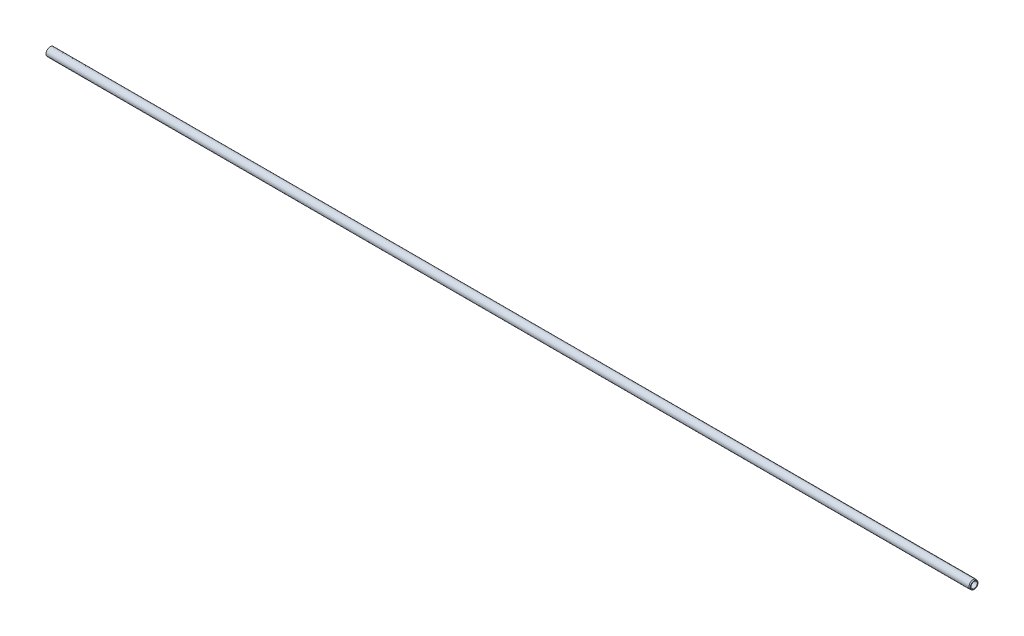
ISO-10303-21;
HEADER;
FILE_DESCRIPTION(('STEP AP214'),'2;1');
FILE_NAME('part.step','',(''),(''),'','','');
FILE_SCHEMA(('AUTOMOTIVE_DESIGN { 1 0 10303 214 1 1 1 1 }'));
ENDSEC;
DATA;
#1=APPLICATION_CONTEXT('core data for automotive mechanical design processes');
#2=APPLICATION_PROTOCOL_DEFINITION('international standard','automotive_design',2000,#1);
#3=PRODUCT_CONTEXT('',#1,'mechanical');
#4=PRODUCT('Part','Part','',(#3));
#5=PRODUCT_RELATED_PRODUCT_CATEGORY('part','',(#4));
#6=PRODUCT_DEFINITION_FORMATION('','',#4);
#7=PRODUCT_DEFINITION_CONTEXT('part definition',#1,'design');
#8=PRODUCT_DEFINITION('design','',#6,#7);
#9=PRODUCT_DEFINITION_SHAPE('','',#8);
#10=(LENGTH_UNIT() NAMED_UNIT(*) SI_UNIT(.MILLI.,.METRE.));
#11=(NAMED_UNIT(*) PLANE_ANGLE_UNIT() SI_UNIT($,.RADIAN.));
#12=(NAMED_UNIT(*) SI_UNIT($,.STERADIAN.) SOLID_ANGLE_UNIT());
#13=UNCERTAINTY_MEASURE_WITH_UNIT(LENGTH_MEASURE(1.E-05),#10,'distance_accuracy_value','');
#14=(GEOMETRIC_REPRESENTATION_CONTEXT(3) GLOBAL_UNCERTAINTY_ASSIGNED_CONTEXT((#13)) GLOBAL_UNIT_ASSIGNED_CONTEXT((#10,
#11,#12)) REPRESENTATION_CONTEXT('',''));
#15=CARTESIAN_POINT('',(0.,0.,0.));
#16=DIRECTION('',(0.,0.,1.));
#17=DIRECTION('',(1.,0.,0.));
#18=AXIS2_PLACEMENT_3D('',#15,#16,#17);
#19=CARTESIAN_POINT('',(0.,0.,0.));
#20=DIRECTION('',(-1.,0.,0.));
#21=DIRECTION('',(0.,0.,1.));
#22=AXIS2_PLACEMENT_3D('',#19,#20,#21);
#23=CYLINDRICAL_SURFACE('',#22,10.);
#24=CARTESIAN_POINT('',(2205.5,0.,0.));
#25=DIRECTION('',(-1.,0.,0.));
#26=DIRECTION('',(0.,0.,1.));
#27=AXIS2_PLACEMENT_3D('',#24,#25,#26);
#28=CIRCLE('',#27,10.);
#29=CARTESIAN_POINT('',(2205.5,0.,10.));
#30=VERTEX_POINT('',#29);
#31=EDGE_CURVE('E10',#30,#30,#28,.T.);
#32=ORIENTED_EDGE('',*,*,#31,.T.);
#33=EDGE_LOOP('',(#32));
#34=FACE_BOUND('',#33,.T.);
#35=CARTESIAN_POINT('',(0.,0.,0.));
#36=DIRECTION('',(-1.,0.,0.));
#37=DIRECTION('',(0.,0.,1.));
#38=AXIS2_PLACEMENT_3D('',#35,#36,#37);
#39=CIRCLE('',#38,10.);
#40=CARTESIAN_POINT('',(0.,0.,10.));
#41=VERTEX_POINT('',#40);
#42=EDGE_CURVE('E64',#41,#41,#39,.T.);
#43=ORIENTED_EDGE('',*,*,#42,.F.);
#44=EDGE_LOOP('',(#43));
#45=FACE_BOUND('',#44,.T.);
#46=ADVANCED_FACE('F45',(#34,#45),#23,.T.);
#47=CARTESIAN_POINT('',(2205.5,0.,0.));
#48=DIRECTION('',(-1.,0.,0.));
#49=DIRECTION('',(0.,0.,1.));
#50=AXIS2_PLACEMENT_3D('',#47,#48,#49);
#51=CONICAL_SURFACE('',#50,10.,0.349065850398866);
#52=CARTESIAN_POINT('',(2208.,0.,0.));
#53=DIRECTION('',(-1.,0.,0.));
#54=DIRECTION('',(0.,0.,1.));
#55=AXIS2_PLACEMENT_3D('',#52,#53,#54);
#56=CIRCLE('',#55,9.09007441433451);
#57=CARTESIAN_POINT('',(2208.,0.,9.09007441433451));
#58=VERTEX_POINT('',#57);
#59=EDGE_CURVE('E51',#58,#58,#56,.T.);
#60=ORIENTED_EDGE('',*,*,#59,.T.);
#61=EDGE_LOOP('',(#60));
#62=FACE_BOUND('',#61,.T.);
#63=ORIENTED_EDGE('',*,*,#31,.F.);
#64=EDGE_LOOP('',(#63));
#65=FACE_BOUND('',#64,.T.);
#66=ADVANCED_FACE('F71',(#62,#65),#51,.T.);
#67=CARTESIAN_POINT('',(2208.,9.09007441433451,0.));
#68=DIRECTION('',(1.,0.,0.));
#69=DIRECTION('',(0.,0.,-1.));
#70=AXIS2_PLACEMENT_3D('',#67,#68,#69);
#71=PLANE('',#70);
#72=CARTESIAN_POINT('',(2208.,0.,0.));
#73=DIRECTION('',(-1.,0.,0.));
#74=DIRECTION('',(0.,0.,1.));
#75=AXIS2_PLACEMENT_3D('',#72,#73,#74);
#76=CIRCLE('',#75,7.5);
#77=CARTESIAN_POINT('',(2208.,0.,7.5));
#78=VERTEX_POINT('',#77);
#79=EDGE_CURVE('E55',#78,#78,#76,.T.);
#80=ORIENTED_EDGE('',*,*,#79,.T.);
#81=EDGE_LOOP('',(#80));
#82=FACE_BOUND('',#81,.T.);
#83=ORIENTED_EDGE('',*,*,#59,.F.);
#84=EDGE_LOOP('',(#83));
#85=FACE_BOUND('',#84,.T.);
#86=ADVANCED_FACE('F75',(#82,#85),#71,.T.);
#87=CARTESIAN_POINT('',(0.,0.,0.));
#88=DIRECTION('',(-1.,0.,0.));
#89=DIRECTION('',(0.,0.,1.));
#90=AXIS2_PLACEMENT_3D('',#87,#88,#89);
#91=CYLINDRICAL_SURFACE('',#90,7.5);
#92=ORIENTED_EDGE('',*,*,#79,.F.);
#93=EDGE_LOOP('',(#92));
#94=FACE_BOUND('',#93,.T.);
#95=CARTESIAN_POINT('',(0.,0.,0.));
#96=DIRECTION('',(-1.,0.,0.));
#97=DIRECTION('',(0.,0.,1.));
#98=AXIS2_PLACEMENT_3D('',#95,#96,#97);
#99=CIRCLE('',#98,7.5);
#100=CARTESIAN_POINT('',(0.,0.,7.5));
#101=VERTEX_POINT('',#100);
#102=EDGE_CURVE('E59',#101,#101,#99,.T.);
#103=ORIENTED_EDGE('',*,*,#102,.T.);
#104=EDGE_LOOP('',(#103));
#105=FACE_BOUND('',#104,.T.);
#106=ADVANCED_FACE('F79',(#94,#105),#91,.F.);
#107=CARTESIAN_POINT('',(0.,10.,0.));
#108=DIRECTION('',(1.,0.,0.));
#109=DIRECTION('',(0.,0.,-1.));
#110=AXIS2_PLACEMENT_3D('',#107,#108,#109);
#111=PLANE('',#110);
#112=ORIENTED_EDGE('',*,*,#102,.F.);
#113=EDGE_LOOP('',(#112));
#114=FACE_BOUND('',#113,.T.);
#115=ORIENTED_EDGE('',*,*,#42,.T.);
#116=EDGE_LOOP('',(#115));
#117=FACE_BOUND('',#116,.T.);
#118=ADVANCED_FACE('F68',(#114,#117),#111,.F.);
#119=CLOSED_SHELL('',(#46,#66,#86,#106,#118));
#120=MANIFOLD_SOLID_BREP('B2',#119);
#121=ADVANCED_BREP_SHAPE_REPRESENTATION('',(#18,#120),#14);
#122=SHAPE_DEFINITION_REPRESENTATION(#9,#121);
ENDSEC;
END-ISO-10303-21;
